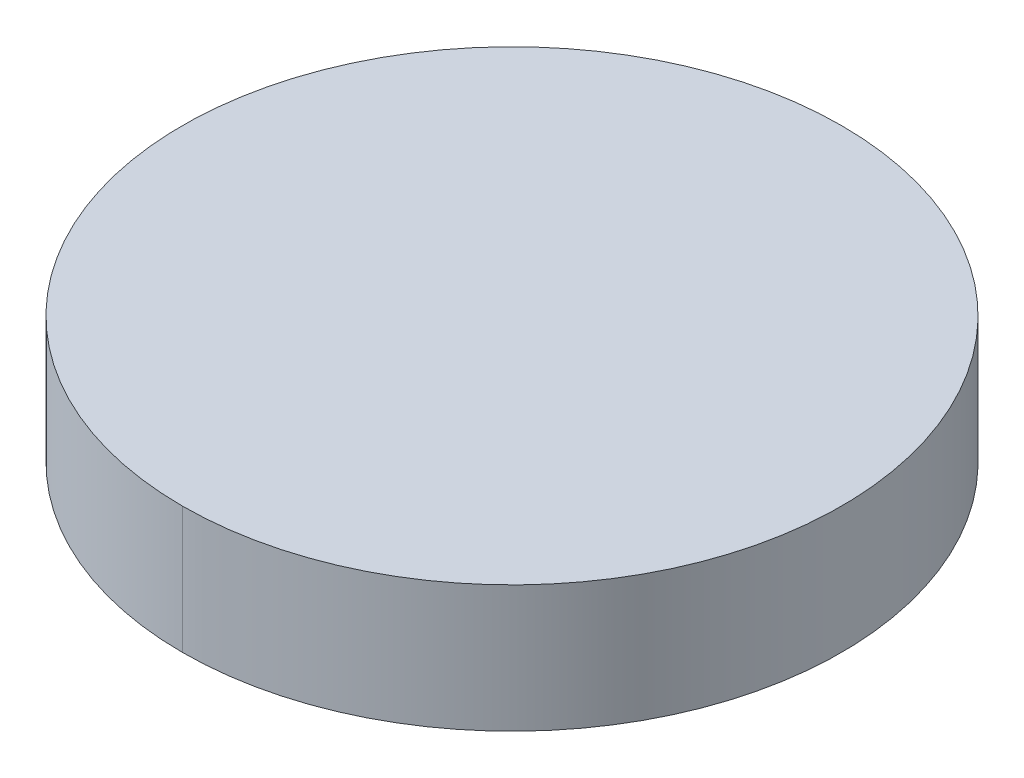
ISO-10303-21;
HEADER;
FILE_DESCRIPTION(('STEP AP214'),'2;1');
FILE_NAME('part.step','',(''),(''),'','','');
FILE_SCHEMA(('AUTOMOTIVE_DESIGN { 1 0 10303 214 1 1 1 1 }'));
ENDSEC;
DATA;
#1=APPLICATION_CONTEXT('core data for automotive mechanical design processes');
#2=APPLICATION_PROTOCOL_DEFINITION('international standard','automotive_design',2000,#1);
#3=PRODUCT_CONTEXT('',#1,'mechanical');
#4=PRODUCT('Part','Part','',(#3));
#5=PRODUCT_RELATED_PRODUCT_CATEGORY('part','',(#4));
#6=PRODUCT_DEFINITION_FORMATION('','',#4);
#7=PRODUCT_DEFINITION_CONTEXT('part definition',#1,'design');
#8=PRODUCT_DEFINITION('design','',#6,#7);
#9=PRODUCT_DEFINITION_SHAPE('','',#8);
#10=(LENGTH_UNIT() NAMED_UNIT(*) SI_UNIT(.MILLI.,.METRE.));
#11=(NAMED_UNIT(*) PLANE_ANGLE_UNIT() SI_UNIT($,.RADIAN.));
#12=(NAMED_UNIT(*) SI_UNIT($,.STERADIAN.) SOLID_ANGLE_UNIT());
#13=UNCERTAINTY_MEASURE_WITH_UNIT(LENGTH_MEASURE(1.E-05),#10,'distance_accuracy_value','');
#14=(GEOMETRIC_REPRESENTATION_CONTEXT(3) GLOBAL_UNCERTAINTY_ASSIGNED_CONTEXT((#13)) GLOBAL_UNIT_ASSIGNED_CONTEXT((#10,
#11,#12)) REPRESENTATION_CONTEXT('',''));
#15=CARTESIAN_POINT('',(0.,0.,0.));
#16=DIRECTION('',(0.,0.,1.));
#17=DIRECTION('',(1.,0.,0.));
#18=AXIS2_PLACEMENT_3D('',#15,#16,#17);
#19=CARTESIAN_POINT('',(0.,3.332166655979,0.));
#20=DIRECTION('',(0.,1.,0.));
#21=DIRECTION('',(0.,0.,1.));
#22=AXIS2_PLACEMENT_3D('',#19,#20,#21);
#23=CYLINDRICAL_SURFACE('',#22,1.3);
#24=CARTESIAN_POINT('',(0.,0.,0.));
#25=DIRECTION('',(0.,-1.,0.));
#26=DIRECTION('',(0.,0.,1.));
#27=AXIS2_PLACEMENT_3D('',#24,#25,#26);
#28=CIRCLE('',#27,1.3);
#29=CARTESIAN_POINT('',(0.,0.,1.3));
#30=VERTEX_POINT('',#29);
#31=CARTESIAN_POINT('',(0.,0.,-1.3));
#32=VERTEX_POINT('',#31);
#33=EDGE_CURVE('E11',#30,#32,#28,.T.);
#34=ORIENTED_EDGE('',*,*,#33,.F.);
#35=DIRECTION('',(0.,-1.,0.));
#36=VECTOR('',#35,1.);
#37=CARTESIAN_POINT('',(0.,0.5,1.3));
#38=LINE('',#37,#36);
#39=CARTESIAN_POINT('',(0.,0.5,1.3));
#40=VERTEX_POINT('',#39);
#41=EDGE_CURVE('E57',#40,#30,#38,.T.);
#42=ORIENTED_EDGE('',*,*,#41,.F.);
#43=CARTESIAN_POINT('',(0.,0.5,0.));
#44=DIRECTION('',(0.,1.,0.));
#45=DIRECTION('',(0.,0.,-1.));
#46=AXIS2_PLACEMENT_3D('',#43,#44,#45);
#47=CIRCLE('',#46,1.3);
#48=CARTESIAN_POINT('',(0.,0.5,-1.3));
#49=VERTEX_POINT('',#48);
#50=EDGE_CURVE('E61',#49,#40,#47,.T.);
#51=ORIENTED_EDGE('',*,*,#50,.F.);
#52=DIRECTION('',(0.,-1.,0.));
#53=VECTOR('',#52,1.);
#54=CARTESIAN_POINT('',(0.,0.5,-1.3));
#55=LINE('',#54,#53);
#56=EDGE_CURVE('E51',#49,#32,#55,.T.);
#57=ORIENTED_EDGE('',*,*,#56,.T.);
#58=EDGE_LOOP('',(#34,#42,#51,#57));
#59=FACE_BOUND('',#58,.T.);
#60=ADVANCED_FACE('F16',(#59),#23,.T.);
#61=CARTESIAN_POINT('',(0.,0.,0.));
#62=DIRECTION('',(0.,-1.,0.));
#63=DIRECTION('',(0.,0.,-1.));
#64=AXIS2_PLACEMENT_3D('',#61,#62,#63);
#65=PLANE('',#64);
#66=ORIENTED_EDGE('',*,*,#33,.T.);
#67=CARTESIAN_POINT('',(0.,0.,0.));
#68=DIRECTION('',(0.,-1.,0.));
#69=DIRECTION('',(0.,0.,-1.));
#70=AXIS2_PLACEMENT_3D('',#67,#68,#69);
#71=CIRCLE('',#70,1.3);
#72=EDGE_CURVE('E26',#32,#30,#71,.T.);
#73=ORIENTED_EDGE('',*,*,#72,.T.);
#74=EDGE_LOOP('',(#66,#73));
#75=FACE_BOUND('',#74,.T.);
#76=ADVANCED_FACE('F93',(#75),#65,.T.);
#77=CARTESIAN_POINT('',(0.,3.332166655979,0.));
#78=DIRECTION('',(0.,1.,0.));
#79=DIRECTION('',(0.,0.,1.));
#80=AXIS2_PLACEMENT_3D('',#77,#78,#79);
#81=CYLINDRICAL_SURFACE('',#80,1.3);
#82=ORIENTED_EDGE('',*,*,#56,.F.);
#83=CARTESIAN_POINT('',(0.,0.5,0.));
#84=DIRECTION('',(0.,1.,0.));
#85=DIRECTION('',(0.,0.,1.));
#86=AXIS2_PLACEMENT_3D('',#83,#84,#85);
#87=CIRCLE('',#86,1.3);
#88=EDGE_CURVE('E20',#40,#49,#87,.T.);
#89=ORIENTED_EDGE('',*,*,#88,.F.);
#90=ORIENTED_EDGE('',*,*,#41,.T.);
#91=ORIENTED_EDGE('',*,*,#72,.F.);
#92=EDGE_LOOP('',(#82,#89,#90,#91));
#93=FACE_BOUND('',#92,.T.);
#94=ADVANCED_FACE('F18',(#93),#81,.T.);
#95=CARTESIAN_POINT('',(-1.3,0.5,0.));
#96=DIRECTION('',(0.,1.,0.));
#97=DIRECTION('',(1.,0.,0.));
#98=AXIS2_PLACEMENT_3D('',#95,#96,#97);
#99=PLANE('',#98);
#100=ORIENTED_EDGE('',*,*,#50,.T.);
#101=ORIENTED_EDGE('',*,*,#88,.T.);
#102=EDGE_LOOP('',(#100,#101));
#103=FACE_BOUND('',#102,.T.);
#104=ADVANCED_FACE('F60',(#103),#99,.T.);
#105=CLOSED_SHELL('',(#60,#76,#94,#104));
#106=MANIFOLD_SOLID_BREP('B1',#105);
#107=ADVANCED_BREP_SHAPE_REPRESENTATION('',(#18,#106),#14);
#108=SHAPE_DEFINITION_REPRESENTATION(#9,#107);
ENDSEC;
END-ISO-10303-21;
